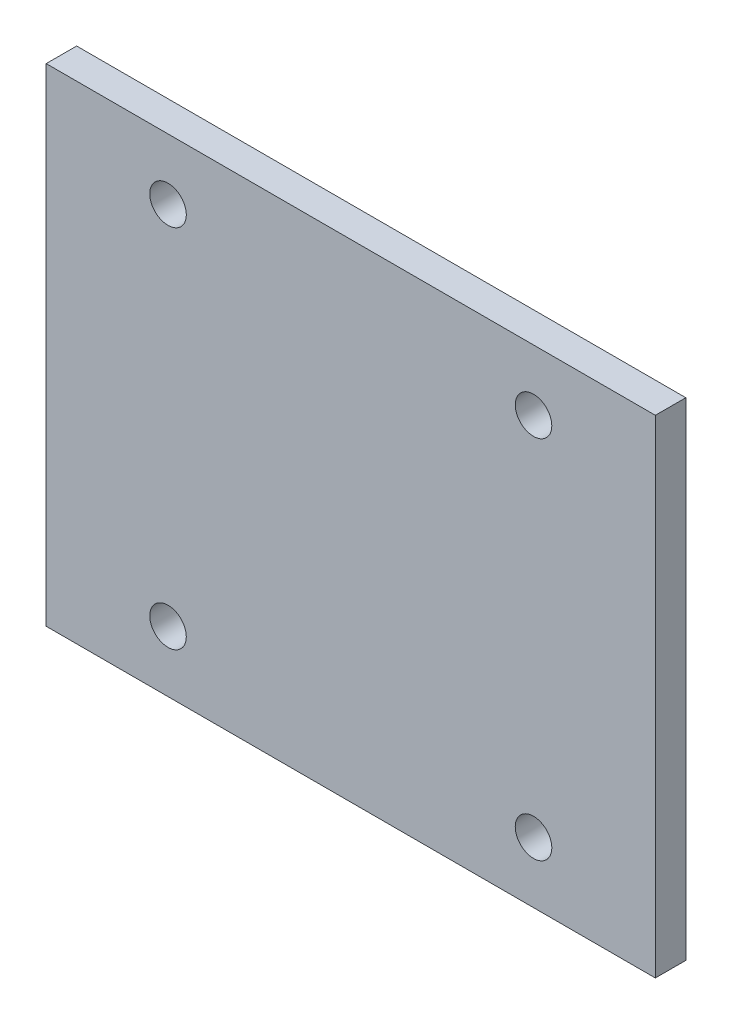
ISO-10303-21;
HEADER;
FILE_DESCRIPTION(('STEP AP214'),'2;1');
FILE_NAME('part.step','',(''),(''),'','','');
FILE_SCHEMA(('AUTOMOTIVE_DESIGN { 1 0 10303 214 1 1 1 1 }'));
ENDSEC;
DATA;
#1=APPLICATION_CONTEXT('core data for automotive mechanical design processes');
#2=APPLICATION_PROTOCOL_DEFINITION('international standard','automotive_design',2000,#1);
#3=PRODUCT_CONTEXT('',#1,'mechanical');
#4=PRODUCT('Part','Part','',(#3));
#5=PRODUCT_RELATED_PRODUCT_CATEGORY('part','',(#4));
#6=PRODUCT_DEFINITION_FORMATION('','',#4);
#7=PRODUCT_DEFINITION_CONTEXT('part definition',#1,'design');
#8=PRODUCT_DEFINITION('design','',#6,#7);
#9=PRODUCT_DEFINITION_SHAPE('','',#8);
#10=(LENGTH_UNIT() NAMED_UNIT(*) SI_UNIT(.MILLI.,.METRE.));
#11=(NAMED_UNIT(*) PLANE_ANGLE_UNIT() SI_UNIT($,.RADIAN.));
#12=(NAMED_UNIT(*) SI_UNIT($,.STERADIAN.) SOLID_ANGLE_UNIT());
#13=UNCERTAINTY_MEASURE_WITH_UNIT(LENGTH_MEASURE(1.E-05),#10,'distance_accuracy_value','');
#14=(GEOMETRIC_REPRESENTATION_CONTEXT(3) GLOBAL_UNCERTAINTY_ASSIGNED_CONTEXT((#13)) GLOBAL_UNIT_ASSIGNED_CONTEXT((#10,
#11,#12)) REPRESENTATION_CONTEXT('',''));
#15=CARTESIAN_POINT('',(0.,0.,0.));
#16=DIRECTION('',(0.,0.,1.));
#17=DIRECTION('',(1.,0.,0.));
#18=AXIS2_PLACEMENT_3D('',#15,#16,#17);
#19=CARTESIAN_POINT('',(25.,-20.,2.5));
#20=DIRECTION('',(-1.,0.,0.));
#21=DIRECTION('',(0.,0.,1.));
#22=AXIS2_PLACEMENT_3D('',#19,#20,#21);
#23=PLANE('',#22);
#24=DIRECTION('',(0.,1.,0.));
#25=VECTOR('',#24,1.);
#26=CARTESIAN_POINT('',(25.,-20.,0.));
#27=LINE('',#26,#25);
#28=CARTESIAN_POINT('',(25.,-20.,0.));
#29=VERTEX_POINT('',#28);
#30=CARTESIAN_POINT('',(25.,20.,0.));
#31=VERTEX_POINT('',#30);
#32=EDGE_CURVE('E111',#29,#31,#27,.T.);
#33=ORIENTED_EDGE('',*,*,#32,.T.);
#34=DIRECTION('',(0.,0.,-1.));
#35=VECTOR('',#34,1.);
#36=CARTESIAN_POINT('',(25.,20.,2.5));
#37=LINE('',#36,#35);
#38=CARTESIAN_POINT('',(25.,20.,2.5));
#39=VERTEX_POINT('',#38);
#40=EDGE_CURVE('E11',#39,#31,#37,.T.);
#41=ORIENTED_EDGE('',*,*,#40,.F.);
#42=DIRECTION('',(0.,1.,0.));
#43=VECTOR('',#42,1.);
#44=CARTESIAN_POINT('',(25.,-20.,2.5));
#45=LINE('',#44,#43);
#46=CARTESIAN_POINT('',(25.,-20.,2.5));
#47=VERTEX_POINT('',#46);
#48=EDGE_CURVE('E95',#47,#39,#45,.T.);
#49=ORIENTED_EDGE('',*,*,#48,.F.);
#50=DIRECTION('',(0.,0.,-1.));
#51=VECTOR('',#50,1.);
#52=CARTESIAN_POINT('',(25.,-20.,2.5));
#53=LINE('',#52,#51);
#54=EDGE_CURVE('E107',#47,#29,#53,.T.);
#55=ORIENTED_EDGE('',*,*,#54,.T.);
#56=EDGE_LOOP('',(#33,#41,#49,#55));
#57=FACE_BOUND('',#56,.T.);
#58=ADVANCED_FACE('F43',(#57),#23,.F.);
#59=CARTESIAN_POINT('',(-25.,20.,2.5));
#60=DIRECTION('',(0.,-1.,0.));
#61=DIRECTION('',(0.,0.,-1.));
#62=AXIS2_PLACEMENT_3D('',#59,#60,#61);
#63=PLANE('',#62);
#64=DIRECTION('',(-1.,0.,0.));
#65=VECTOR('',#64,1.);
#66=CARTESIAN_POINT('',(-25.,20.,0.));
#67=LINE('',#66,#65);
#68=CARTESIAN_POINT('',(-25.,20.,0.));
#69=VERTEX_POINT('',#68);
#70=EDGE_CURVE('E100',#31,#69,#67,.T.);
#71=ORIENTED_EDGE('',*,*,#70,.T.);
#72=DIRECTION('',(0.,0.,-1.));
#73=VECTOR('',#72,1.);
#74=CARTESIAN_POINT('',(-25.,20.,2.5));
#75=LINE('',#74,#73);
#76=CARTESIAN_POINT('',(-25.,20.,2.5));
#77=VERTEX_POINT('',#76);
#78=EDGE_CURVE('E52',#77,#69,#75,.T.);
#79=ORIENTED_EDGE('',*,*,#78,.F.);
#80=DIRECTION('',(-1.,0.,0.));
#81=VECTOR('',#80,1.);
#82=CARTESIAN_POINT('',(-25.,20.,2.5));
#83=LINE('',#82,#81);
#84=EDGE_CURVE('E90',#39,#77,#83,.T.);
#85=ORIENTED_EDGE('',*,*,#84,.F.);
#86=ORIENTED_EDGE('',*,*,#40,.T.);
#87=EDGE_LOOP('',(#71,#79,#85,#86));
#88=FACE_BOUND('',#87,.T.);
#89=ADVANCED_FACE('F99',(#88),#63,.F.);
#90=CARTESIAN_POINT('',(-25.,-20.,2.5));
#91=DIRECTION('',(1.,0.,0.));
#92=DIRECTION('',(0.,0.,-1.));
#93=AXIS2_PLACEMENT_3D('',#90,#91,#92);
#94=PLANE('',#93);
#95=DIRECTION('',(0.,-1.,0.));
#96=VECTOR('',#95,1.);
#97=CARTESIAN_POINT('',(-25.,-20.,0.));
#98=LINE('',#97,#96);
#99=CARTESIAN_POINT('',(-25.,-20.,0.));
#100=VERTEX_POINT('',#99);
#101=EDGE_CURVE('E77',#69,#100,#98,.T.);
#102=ORIENTED_EDGE('',*,*,#101,.T.);
#103=DIRECTION('',(0.,0.,-1.));
#104=VECTOR('',#103,1.);
#105=CARTESIAN_POINT('',(-25.,-20.,2.5));
#106=LINE('',#105,#104);
#107=CARTESIAN_POINT('',(-25.,-20.,2.5));
#108=VERTEX_POINT('',#107);
#109=EDGE_CURVE('E102',#108,#100,#106,.T.);
#110=ORIENTED_EDGE('',*,*,#109,.F.);
#111=DIRECTION('',(0.,-1.,0.));
#112=VECTOR('',#111,1.);
#113=CARTESIAN_POINT('',(-25.,-20.,2.5));
#114=LINE('',#113,#112);
#115=EDGE_CURVE('E93',#77,#108,#114,.T.);
#116=ORIENTED_EDGE('',*,*,#115,.F.);
#117=ORIENTED_EDGE('',*,*,#78,.T.);
#118=EDGE_LOOP('',(#102,#110,#116,#117));
#119=FACE_BOUND('',#118,.T.);
#120=ADVANCED_FACE('F103',(#119),#94,.F.);
#121=CARTESIAN_POINT('',(-25.,-20.,2.5));
#122=DIRECTION('',(0.,1.,0.));
#123=DIRECTION('',(0.,0.,1.));
#124=AXIS2_PLACEMENT_3D('',#121,#122,#123);
#125=PLANE('',#124);
#126=DIRECTION('',(1.,0.,0.));
#127=VECTOR('',#126,1.);
#128=CARTESIAN_POINT('',(-25.,-20.,0.));
#129=LINE('',#128,#127);
#130=EDGE_CURVE('E83',#100,#29,#129,.T.);
#131=ORIENTED_EDGE('',*,*,#130,.T.);
#132=ORIENTED_EDGE('',*,*,#54,.F.);
#133=DIRECTION('',(1.,0.,0.));
#134=VECTOR('',#133,1.);
#135=CARTESIAN_POINT('',(-25.,-20.,2.5));
#136=LINE('',#135,#134);
#137=EDGE_CURVE('E60',#108,#47,#136,.T.);
#138=ORIENTED_EDGE('',*,*,#137,.F.);
#139=ORIENTED_EDGE('',*,*,#109,.T.);
#140=EDGE_LOOP('',(#131,#132,#138,#139));
#141=FACE_BOUND('',#140,.T.);
#142=ADVANCED_FACE('F125',(#141),#125,.F.);
#143=CARTESIAN_POINT('',(0.,0.,2.5));
#144=DIRECTION('',(0.,0.,-1.));
#145=DIRECTION('',(-1.,0.,0.));
#146=AXIS2_PLACEMENT_3D('',#143,#144,#145);
#147=PLANE('',#146);
#148=CARTESIAN_POINT('',(-15.,15.,2.5));
#149=DIRECTION('',(0.,0.,1.));
#150=DIRECTION('',(-1.,0.,0.));
#151=AXIS2_PLACEMENT_3D('',#148,#149,#150);
#152=CIRCLE('',#151,1.5);
#153=CARTESIAN_POINT('',(-16.5,15.,2.5));
#154=VERTEX_POINT('',#153);
#155=EDGE_CURVE('E144',#154,#154,#152,.T.);
#156=ORIENTED_EDGE('',*,*,#155,.F.);
#157=EDGE_LOOP('',(#156));
#158=FACE_BOUND('',#157,.T.);
#159=CARTESIAN_POINT('',(-15.,-15.,2.5));
#160=DIRECTION('',(0.,0.,1.));
#161=DIRECTION('',(1.,0.,0.));
#162=AXIS2_PLACEMENT_3D('',#159,#160,#161);
#163=CIRCLE('',#162,1.5);
#164=CARTESIAN_POINT('',(-13.5,-15.,2.5));
#165=VERTEX_POINT('',#164);
#166=EDGE_CURVE('E152',#165,#165,#163,.T.);
#167=ORIENTED_EDGE('',*,*,#166,.F.);
#168=EDGE_LOOP('',(#167));
#169=FACE_BOUND('',#168,.T.);
#170=CARTESIAN_POINT('',(15.,-15.,2.5));
#171=DIRECTION('',(0.,0.,1.));
#172=DIRECTION('',(-1.,0.,0.));
#173=AXIS2_PLACEMENT_3D('',#170,#171,#172);
#174=CIRCLE('',#173,1.5);
#175=CARTESIAN_POINT('',(13.5,-15.,2.5));
#176=VERTEX_POINT('',#175);
#177=EDGE_CURVE('E136',#176,#176,#174,.T.);
#178=ORIENTED_EDGE('',*,*,#177,.F.);
#179=EDGE_LOOP('',(#178));
#180=FACE_BOUND('',#179,.T.);
#181=CARTESIAN_POINT('',(15.,15.,2.5));
#182=DIRECTION('',(0.,0.,1.));
#183=DIRECTION('',(1.,0.,0.));
#184=AXIS2_PLACEMENT_3D('',#181,#182,#183);
#185=CIRCLE('',#184,1.5);
#186=CARTESIAN_POINT('',(16.5,15.,2.5));
#187=VERTEX_POINT('',#186);
#188=EDGE_CURVE('E132',#187,#187,#185,.T.);
#189=ORIENTED_EDGE('',*,*,#188,.F.);
#190=EDGE_LOOP('',(#189));
#191=FACE_BOUND('',#190,.T.);
#192=ORIENTED_EDGE('',*,*,#48,.T.);
#193=ORIENTED_EDGE('',*,*,#84,.T.);
#194=ORIENTED_EDGE('',*,*,#115,.T.);
#195=ORIENTED_EDGE('',*,*,#137,.T.);
#196=EDGE_LOOP('',(#192,#193,#194,#195));
#197=FACE_BOUND('',#196,.T.);
#198=ADVANCED_FACE('F91',(#158,#169,#180,#191,#197),#147,.F.);
#199=CARTESIAN_POINT('',(0.,0.,0.));
#200=DIRECTION('',(0.,0.,-1.));
#201=DIRECTION('',(-1.,0.,0.));
#202=AXIS2_PLACEMENT_3D('',#199,#200,#201);
#203=PLANE('',#202);
#204=CARTESIAN_POINT('',(-15.,15.,0.));
#205=DIRECTION('',(0.,0.,1.));
#206=DIRECTION('',(-1.,0.,0.));
#207=AXIS2_PLACEMENT_3D('',#204,#205,#206);
#208=CIRCLE('',#207,1.5);
#209=CARTESIAN_POINT('',(-16.5,15.,0.));
#210=VERTEX_POINT('',#209);
#211=EDGE_CURVE('E140',#210,#210,#208,.T.);
#212=ORIENTED_EDGE('',*,*,#211,.T.);
#213=EDGE_LOOP('',(#212));
#214=FACE_BOUND('',#213,.T.);
#215=CARTESIAN_POINT('',(-15.,-15.,0.));
#216=DIRECTION('',(0.,0.,1.));
#217=DIRECTION('',(1.,0.,0.));
#218=AXIS2_PLACEMENT_3D('',#215,#216,#217);
#219=CIRCLE('',#218,1.5);
#220=CARTESIAN_POINT('',(-13.5,-15.,0.));
#221=VERTEX_POINT('',#220);
#222=EDGE_CURVE('E148',#221,#221,#219,.T.);
#223=ORIENTED_EDGE('',*,*,#222,.T.);
#224=EDGE_LOOP('',(#223));
#225=FACE_BOUND('',#224,.T.);
#226=CARTESIAN_POINT('',(15.,-15.,0.));
#227=DIRECTION('',(0.,0.,1.));
#228=DIRECTION('',(-1.,0.,0.));
#229=AXIS2_PLACEMENT_3D('',#226,#227,#228);
#230=CIRCLE('',#229,1.5);
#231=CARTESIAN_POINT('',(13.5,-15.,0.));
#232=VERTEX_POINT('',#231);
#233=EDGE_CURVE('E156',#232,#232,#230,.T.);
#234=ORIENTED_EDGE('',*,*,#233,.T.);
#235=EDGE_LOOP('',(#234));
#236=FACE_BOUND('',#235,.T.);
#237=CARTESIAN_POINT('',(15.,15.,0.));
#238=DIRECTION('',(0.,0.,1.));
#239=DIRECTION('',(1.,0.,0.));
#240=AXIS2_PLACEMENT_3D('',#237,#238,#239);
#241=CIRCLE('',#240,1.5);
#242=CARTESIAN_POINT('',(16.5,15.,0.));
#243=VERTEX_POINT('',#242);
#244=EDGE_CURVE('E115',#243,#243,#241,.T.);
#245=ORIENTED_EDGE('',*,*,#244,.T.);
#246=EDGE_LOOP('',(#245));
#247=FACE_BOUND('',#246,.T.);
#248=ORIENTED_EDGE('',*,*,#32,.F.);
#249=ORIENTED_EDGE('',*,*,#130,.F.);
#250=ORIENTED_EDGE('',*,*,#101,.F.);
#251=ORIENTED_EDGE('',*,*,#70,.F.);
#252=EDGE_LOOP('',(#248,#249,#250,#251));
#253=FACE_BOUND('',#252,.T.);
#254=ADVANCED_FACE('F128',(#214,#225,#236,#247,#253),#203,.T.);
#255=CARTESIAN_POINT('',(15.,15.,0.));
#256=DIRECTION('',(0.,0.,1.));
#257=DIRECTION('',(1.,0.,0.));
#258=AXIS2_PLACEMENT_3D('',#255,#256,#257);
#259=CYLINDRICAL_SURFACE('',#258,1.5);
#260=ORIENTED_EDGE('',*,*,#244,.F.);
#261=EDGE_LOOP('',(#260));
#262=FACE_BOUND('',#261,.T.);
#263=ORIENTED_EDGE('',*,*,#188,.T.);
#264=EDGE_LOOP('',(#263));
#265=FACE_BOUND('',#264,.T.);
#266=ADVANCED_FACE('F172',(#262,#265),#259,.F.);
#267=CARTESIAN_POINT('',(15.,-15.,0.));
#268=DIRECTION('',(0.,0.,1.));
#269=DIRECTION('',(1.,0.,0.));
#270=AXIS2_PLACEMENT_3D('',#267,#268,#269);
#271=CYLINDRICAL_SURFACE('',#270,1.5);
#272=ORIENTED_EDGE('',*,*,#233,.F.);
#273=EDGE_LOOP('',(#272));
#274=FACE_BOUND('',#273,.T.);
#275=ORIENTED_EDGE('',*,*,#177,.T.);
#276=EDGE_LOOP('',(#275));
#277=FACE_BOUND('',#276,.T.);
#278=ADVANCED_FACE('F164',(#274,#277),#271,.F.);
#279=CARTESIAN_POINT('',(-15.,-15.,0.));
#280=DIRECTION('',(0.,0.,1.));
#281=DIRECTION('',(1.,0.,0.));
#282=AXIS2_PLACEMENT_3D('',#279,#280,#281);
#283=CYLINDRICAL_SURFACE('',#282,1.5);
#284=ORIENTED_EDGE('',*,*,#222,.F.);
#285=EDGE_LOOP('',(#284));
#286=FACE_BOUND('',#285,.T.);
#287=ORIENTED_EDGE('',*,*,#166,.T.);
#288=EDGE_LOOP('',(#287));
#289=FACE_BOUND('',#288,.T.);
#290=ADVANCED_FACE('F180',(#286,#289),#283,.F.);
#291=CARTESIAN_POINT('',(-15.,15.,0.));
#292=DIRECTION('',(0.,0.,1.));
#293=DIRECTION('',(1.,0.,0.));
#294=AXIS2_PLACEMENT_3D('',#291,#292,#293);
#295=CYLINDRICAL_SURFACE('',#294,1.5);
#296=ORIENTED_EDGE('',*,*,#211,.F.);
#297=EDGE_LOOP('',(#296));
#298=FACE_BOUND('',#297,.T.);
#299=ORIENTED_EDGE('',*,*,#155,.T.);
#300=EDGE_LOOP('',(#299));
#301=FACE_BOUND('',#300,.T.);
#302=ADVANCED_FACE('F231',(#298,#301),#295,.F.);
#303=CLOSED_SHELL('',(#58,#89,#120,#142,#198,#254,#266,#278,#290,#302));
#304=MANIFOLD_SOLID_BREP('B2',#303);
#305=ADVANCED_BREP_SHAPE_REPRESENTATION('',(#18,#304),#14);
#306=SHAPE_DEFINITION_REPRESENTATION(#9,#305);
ENDSEC;
END-ISO-10303-21;
